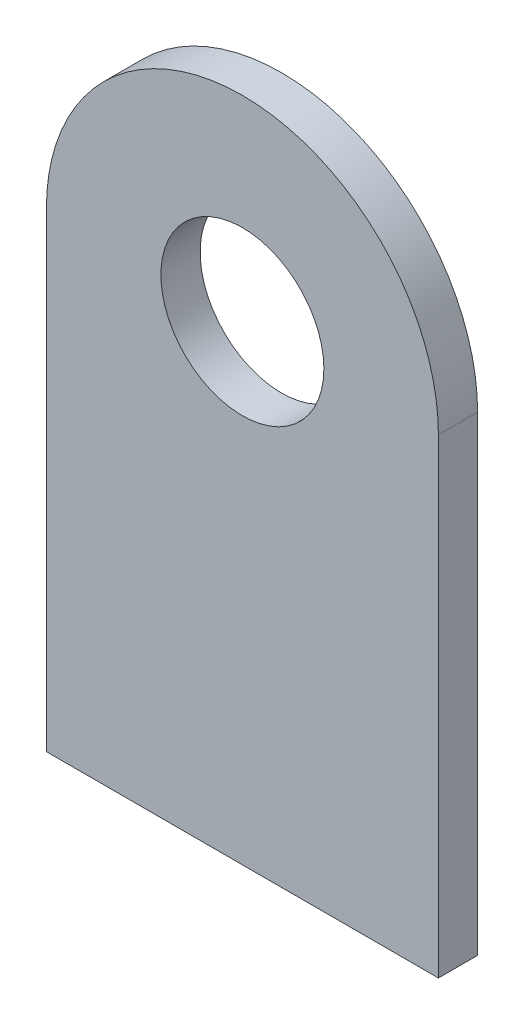
ISO-10303-21;
HEADER;
FILE_DESCRIPTION(('STEP AP214'),'2;1');
FILE_NAME('part.step','',(''),(''),'','','');
FILE_SCHEMA(('AUTOMOTIVE_DESIGN { 1 0 10303 214 1 1 1 1 }'));
ENDSEC;
DATA;
#1=APPLICATION_CONTEXT('core data for automotive mechanical design processes');
#2=APPLICATION_PROTOCOL_DEFINITION('international standard','automotive_design',2000,#1);
#3=PRODUCT_CONTEXT('',#1,'mechanical');
#4=PRODUCT('Part','Part','',(#3));
#5=PRODUCT_RELATED_PRODUCT_CATEGORY('part','',(#4));
#6=PRODUCT_DEFINITION_FORMATION('','',#4);
#7=PRODUCT_DEFINITION_CONTEXT('part definition',#1,'design');
#8=PRODUCT_DEFINITION('design','',#6,#7);
#9=PRODUCT_DEFINITION_SHAPE('','',#8);
#10=(LENGTH_UNIT() NAMED_UNIT(*) SI_UNIT(.MILLI.,.METRE.));
#11=(NAMED_UNIT(*) PLANE_ANGLE_UNIT() SI_UNIT($,.RADIAN.));
#12=(NAMED_UNIT(*) SI_UNIT($,.STERADIAN.) SOLID_ANGLE_UNIT());
#13=UNCERTAINTY_MEASURE_WITH_UNIT(LENGTH_MEASURE(1.E-05),#10,'distance_accuracy_value','');
#14=(GEOMETRIC_REPRESENTATION_CONTEXT(3) GLOBAL_UNCERTAINTY_ASSIGNED_CONTEXT((#13)) GLOBAL_UNIT_ASSIGNED_CONTEXT((#10,
#11,#12)) REPRESENTATION_CONTEXT('',''));
#15=CARTESIAN_POINT('',(0.,0.,0.));
#16=DIRECTION('',(0.,0.,1.));
#17=DIRECTION('',(1.,0.,0.));
#18=AXIS2_PLACEMENT_3D('',#15,#16,#17);
#19=CARTESIAN_POINT('',(0.,0.,1.5875));
#20=DIRECTION('',(0.,0.,-1.));
#21=DIRECTION('',(-1.,0.,0.));
#22=AXIS2_PLACEMENT_3D('',#19,#20,#21);
#23=CYLINDRICAL_SURFACE('',#22,7.9375);
#24=CARTESIAN_POINT('',(0.,0.,0.));
#25=DIRECTION('',(0.,0.,1.));
#26=DIRECTION('',(1.,0.,0.));
#27=AXIS2_PLACEMENT_3D('',#24,#25,#26);
#28=CIRCLE('',#27,7.9375);
#29=CARTESIAN_POINT('',(7.9375,0.,0.));
#30=VERTEX_POINT('',#29);
#31=CARTESIAN_POINT('',(-7.9375,0.,0.));
#32=VERTEX_POINT('',#31);
#33=EDGE_CURVE('E87',#30,#32,#28,.T.);
#34=ORIENTED_EDGE('',*,*,#33,.T.);
#35=DIRECTION('',(0.,0.,-1.));
#36=VECTOR('',#35,1.);
#37=CARTESIAN_POINT('',(-7.9375,0.,1.5875));
#38=LINE('',#37,#36);
#39=CARTESIAN_POINT('',(-7.9375,0.,1.5875));
#40=VERTEX_POINT('',#39);
#41=EDGE_CURVE('E11',#40,#32,#38,.T.);
#42=ORIENTED_EDGE('',*,*,#41,.F.);
#43=CARTESIAN_POINT('',(0.,0.,1.5875));
#44=DIRECTION('',(0.,0.,1.));
#45=DIRECTION('',(1.,0.,0.));
#46=AXIS2_PLACEMENT_3D('',#43,#44,#45);
#47=CIRCLE('',#46,7.9375);
#48=CARTESIAN_POINT('',(7.9375,0.,1.5875));
#49=VERTEX_POINT('',#48);
#50=EDGE_CURVE('E81',#49,#40,#47,.T.);
#51=ORIENTED_EDGE('',*,*,#50,.F.);
#52=DIRECTION('',(0.,0.,-1.));
#53=VECTOR('',#52,1.);
#54=CARTESIAN_POINT('',(7.9375,0.,1.5875));
#55=LINE('',#54,#53);
#56=EDGE_CURVE('E43',#49,#30,#55,.T.);
#57=ORIENTED_EDGE('',*,*,#56,.T.);
#58=EDGE_LOOP('',(#34,#42,#51,#57));
#59=FACE_BOUND('',#58,.T.);
#60=ADVANCED_FACE('F36',(#59),#23,.T.);
#61=CARTESIAN_POINT('',(-7.9375,0.,1.5875));
#62=DIRECTION('',(1.,0.,0.));
#63=DIRECTION('',(0.,1.,0.));
#64=AXIS2_PLACEMENT_3D('',#61,#62,#63);
#65=PLANE('',#64);
#66=DIRECTION('',(0.,-1.,0.));
#67=VECTOR('',#66,1.);
#68=CARTESIAN_POINT('',(-7.9375,0.,0.));
#69=LINE('',#68,#67);
#70=CARTESIAN_POINT('',(-7.9375,-19.05,0.));
#71=VERTEX_POINT('',#70);
#72=EDGE_CURVE('E82',#32,#71,#69,.T.);
#73=ORIENTED_EDGE('',*,*,#72,.T.);
#74=DIRECTION('',(0.,0.,1.));
#75=VECTOR('',#74,1.);
#76=CARTESIAN_POINT('',(-7.9375,-19.05,0.));
#77=LINE('',#76,#75);
#78=CARTESIAN_POINT('',(-7.9375,-19.05,1.5875));
#79=VERTEX_POINT('',#78);
#80=EDGE_CURVE('E50',#71,#79,#77,.T.);
#81=ORIENTED_EDGE('',*,*,#80,.T.);
#82=DIRECTION('',(0.,-1.,0.));
#83=VECTOR('',#82,1.);
#84=CARTESIAN_POINT('',(-7.9375,0.,1.5875));
#85=LINE('',#84,#83);
#86=EDGE_CURVE('E98',#40,#79,#85,.T.);
#87=ORIENTED_EDGE('',*,*,#86,.F.);
#88=ORIENTED_EDGE('',*,*,#41,.T.);
#89=EDGE_LOOP('',(#73,#81,#87,#88));
#90=FACE_BOUND('',#89,.T.);
#91=ADVANCED_FACE('F110',(#90),#65,.F.);
#92=CARTESIAN_POINT('',(7.9375,0.,1.5875));
#93=DIRECTION('',(-1.,0.,0.));
#94=DIRECTION('',(0.,-1.,0.));
#95=AXIS2_PLACEMENT_3D('',#92,#93,#94);
#96=PLANE('',#95);
#97=DIRECTION('',(0.,1.,0.));
#98=VECTOR('',#97,1.);
#99=CARTESIAN_POINT('',(7.9375,0.,1.5875));
#100=LINE('',#99,#98);
#101=CARTESIAN_POINT('',(7.93749999999999,-19.05,1.5875));
#102=VERTEX_POINT('',#101);
#103=EDGE_CURVE('E59',#102,#49,#100,.T.);
#104=ORIENTED_EDGE('',*,*,#103,.F.);
#105=DIRECTION('',(0.,0.,1.));
#106=VECTOR('',#105,1.);
#107=CARTESIAN_POINT('',(7.93749999999999,-19.05,0.));
#108=LINE('',#107,#106);
#109=CARTESIAN_POINT('',(7.93749999999999,-19.05,0.));
#110=VERTEX_POINT('',#109);
#111=EDGE_CURVE('E78',#110,#102,#108,.T.);
#112=ORIENTED_EDGE('',*,*,#111,.F.);
#113=DIRECTION('',(0.,1.,0.));
#114=VECTOR('',#113,1.);
#115=CARTESIAN_POINT('',(7.9375,0.,0.));
#116=LINE('',#115,#114);
#117=EDGE_CURVE('E73',#110,#30,#116,.T.);
#118=ORIENTED_EDGE('',*,*,#117,.T.);
#119=ORIENTED_EDGE('',*,*,#56,.F.);
#120=EDGE_LOOP('',(#104,#112,#118,#119));
#121=FACE_BOUND('',#120,.T.);
#122=ADVANCED_FACE('F75',(#121),#96,.F.);
#123=CARTESIAN_POINT('',(0.,0.,1.5875));
#124=DIRECTION('',(0.,0.,1.));
#125=DIRECTION('',(1.,0.,0.));
#126=AXIS2_PLACEMENT_3D('',#123,#124,#125);
#127=PLANE('',#126);
#128=DIRECTION('',(-1.,0.,0.));
#129=VECTOR('',#128,1.);
#130=CARTESIAN_POINT('',(7.93749999999999,-19.05,1.5875));
#131=LINE('',#130,#129);
#132=EDGE_CURVE('E107',#102,#79,#131,.T.);
#133=ORIENTED_EDGE('',*,*,#132,.F.);
#134=ORIENTED_EDGE('',*,*,#103,.T.);
#135=ORIENTED_EDGE('',*,*,#50,.T.);
#136=ORIENTED_EDGE('',*,*,#86,.T.);
#137=EDGE_LOOP('',(#133,#134,#135,#136));
#138=FACE_BOUND('',#137,.T.);
#139=CARTESIAN_POINT('',(0.,0.,1.5875));
#140=DIRECTION('',(0.,0.,1.));
#141=DIRECTION('',(1.,0.,0.));
#142=AXIS2_PLACEMENT_3D('',#139,#140,#141);
#143=CIRCLE('',#142,3.3);
#144=CARTESIAN_POINT('',(3.3,0.,1.5875));
#145=VERTEX_POINT('',#144);
#146=EDGE_CURVE('E94',#145,#145,#143,.T.);
#147=ORIENTED_EDGE('',*,*,#146,.F.);
#148=EDGE_LOOP('',(#147));
#149=FACE_BOUND('',#148,.T.);
#150=ADVANCED_FACE('F112',(#138,#149),#127,.T.);
#151=CARTESIAN_POINT('',(0.,0.,0.));
#152=DIRECTION('',(0.,0.,1.));
#153=DIRECTION('',(1.,0.,0.));
#154=AXIS2_PLACEMENT_3D('',#151,#152,#153);
#155=PLANE('',#154);
#156=CARTESIAN_POINT('',(0.,0.,0.));
#157=DIRECTION('',(0.,0.,1.));
#158=DIRECTION('',(1.,0.,0.));
#159=AXIS2_PLACEMENT_3D('',#156,#157,#158);
#160=CIRCLE('',#159,3.3);
#161=CARTESIAN_POINT('',(3.3,0.,0.));
#162=VERTEX_POINT('',#161);
#163=EDGE_CURVE('E90',#162,#162,#160,.T.);
#164=ORIENTED_EDGE('',*,*,#163,.T.);
#165=EDGE_LOOP('',(#164));
#166=FACE_BOUND('',#165,.T.);
#167=ORIENTED_EDGE('',*,*,#117,.F.);
#168=DIRECTION('',(-1.,0.,0.));
#169=VECTOR('',#168,1.);
#170=CARTESIAN_POINT('',(7.93749999999999,-19.05,0.));
#171=LINE('',#170,#169);
#172=EDGE_CURVE('E105',#110,#71,#171,.T.);
#173=ORIENTED_EDGE('',*,*,#172,.T.);
#174=ORIENTED_EDGE('',*,*,#72,.F.);
#175=ORIENTED_EDGE('',*,*,#33,.F.);
#176=EDGE_LOOP('',(#167,#173,#174,#175));
#177=FACE_BOUND('',#176,.T.);
#178=ADVANCED_FACE('F88',(#166,#177),#155,.F.);
#179=CARTESIAN_POINT('',(0.,0.,1.5875));
#180=DIRECTION('',(0.,0.,1.));
#181=DIRECTION('',(1.,0.,0.));
#182=AXIS2_PLACEMENT_3D('',#179,#180,#181);
#183=CYLINDRICAL_SURFACE('',#182,3.3);
#184=ORIENTED_EDGE('',*,*,#163,.F.);
#185=EDGE_LOOP('',(#184));
#186=FACE_BOUND('',#185,.T.);
#187=ORIENTED_EDGE('',*,*,#146,.T.);
#188=EDGE_LOOP('',(#187));
#189=FACE_BOUND('',#188,.T.);
#190=ADVANCED_FACE('F119',(#186,#189),#183,.F.);
#191=CARTESIAN_POINT('',(7.93749999999999,-19.05,0.));
#192=DIRECTION('',(0.,1.,0.));
#193=DIRECTION('',(-1.,0.,0.));
#194=AXIS2_PLACEMENT_3D('',#191,#192,#193);
#195=PLANE('',#194);
#196=ORIENTED_EDGE('',*,*,#132,.T.);
#197=ORIENTED_EDGE('',*,*,#80,.F.);
#198=ORIENTED_EDGE('',*,*,#172,.F.);
#199=ORIENTED_EDGE('',*,*,#111,.T.);
#200=EDGE_LOOP('',(#196,#197,#198,#199));
#201=FACE_BOUND('',#200,.T.);
#202=ADVANCED_FACE('F121',(#201),#195,.F.);
#203=CLOSED_SHELL('',(#60,#91,#122,#150,#178,#190,#202));
#204=MANIFOLD_SOLID_BREP('B2',#203);
#205=ADVANCED_BREP_SHAPE_REPRESENTATION('',(#18,#204),#14);
#206=SHAPE_DEFINITION_REPRESENTATION(#9,#205);
ENDSEC;
END-ISO-10303-21;
